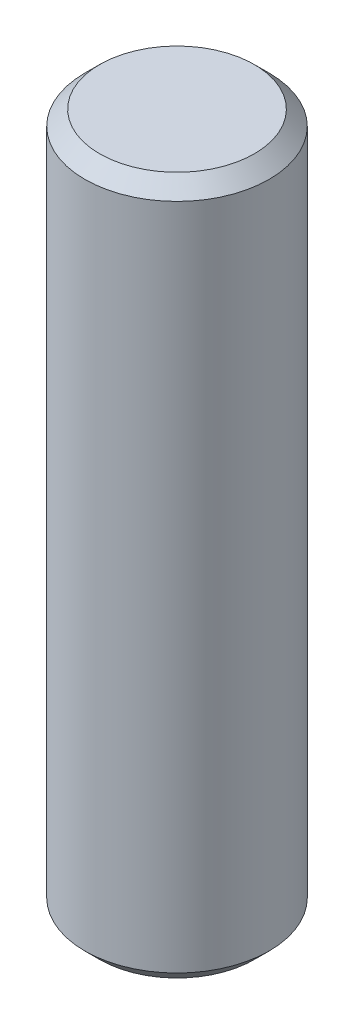
ISO-10303-21;
HEADER;
FILE_DESCRIPTION(('STEP AP214'),'2;1');
FILE_NAME('part.step','',(''),(''),'','','');
FILE_SCHEMA(('AUTOMOTIVE_DESIGN { 1 0 10303 214 1 1 1 1 }'));
ENDSEC;
DATA;
#1=APPLICATION_CONTEXT('core data for automotive mechanical design processes');
#2=APPLICATION_PROTOCOL_DEFINITION('international standard','automotive_design',2000,#1);
#3=PRODUCT_CONTEXT('',#1,'mechanical');
#4=PRODUCT('Part','Part','',(#3));
#5=PRODUCT_RELATED_PRODUCT_CATEGORY('part','',(#4));
#6=PRODUCT_DEFINITION_FORMATION('','',#4);
#7=PRODUCT_DEFINITION_CONTEXT('part definition',#1,'design');
#8=PRODUCT_DEFINITION('design','',#6,#7);
#9=PRODUCT_DEFINITION_SHAPE('','',#8);
#10=(LENGTH_UNIT() NAMED_UNIT(*) SI_UNIT(.MILLI.,.METRE.));
#11=(NAMED_UNIT(*) PLANE_ANGLE_UNIT() SI_UNIT($,.RADIAN.));
#12=(NAMED_UNIT(*) SI_UNIT($,.STERADIAN.) SOLID_ANGLE_UNIT());
#13=UNCERTAINTY_MEASURE_WITH_UNIT(LENGTH_MEASURE(1.E-05),#10,'distance_accuracy_value','');
#14=(GEOMETRIC_REPRESENTATION_CONTEXT(3) GLOBAL_UNCERTAINTY_ASSIGNED_CONTEXT((#13)) GLOBAL_UNIT_ASSIGNED_CONTEXT((#10,
#11,#12)) REPRESENTATION_CONTEXT('',''));
#15=CARTESIAN_POINT('',(0.,0.,0.));
#16=DIRECTION('',(0.,0.,1.));
#17=DIRECTION('',(1.,0.,0.));
#18=AXIS2_PLACEMENT_3D('',#15,#16,#17);
#19=CARTESIAN_POINT('',(0.,24.,0.));
#20=DIRECTION('',(0.,-1.,0.));
#21=DIRECTION('',(0.,0.,-1.));
#22=AXIS2_PLACEMENT_3D('',#19,#20,#21);
#23=CYLINDRICAL_SURFACE('',#22,3.16865);
#24=CARTESIAN_POINT('',(0.,23.492,0.));
#25=DIRECTION('',(0.,1.,0.));
#26=DIRECTION('',(0.,0.,1.));
#27=AXIS2_PLACEMENT_3D('',#24,#25,#26);
#28=CIRCLE('',#27,3.16865);
#29=CARTESIAN_POINT('',(0.,23.492,3.16865));
#30=VERTEX_POINT('',#29);
#31=EDGE_CURVE('E37',#30,#30,#28,.F.);
#32=ORIENTED_EDGE('',*,*,#31,.T.);
#33=EDGE_LOOP('',(#32));
#34=FACE_BOUND('',#33,.T.);
#35=CARTESIAN_POINT('',(0.,0.508000000000002,0.));
#36=DIRECTION('',(0.,1.,0.));
#37=DIRECTION('',(0.,0.,1.));
#38=AXIS2_PLACEMENT_3D('',#35,#36,#37);
#39=CIRCLE('',#38,3.16865);
#40=CARTESIAN_POINT('',(0.,0.508000000000002,3.16865));
#41=VERTEX_POINT('',#40);
#42=EDGE_CURVE('E41',#41,#41,#39,.T.);
#43=ORIENTED_EDGE('',*,*,#42,.T.);
#44=EDGE_LOOP('',(#43));
#45=FACE_BOUND('',#44,.T.);
#46=ADVANCED_FACE('F30',(#34,#45),#23,.T.);
#47=CARTESIAN_POINT('',(0.,24.,0.));
#48=DIRECTION('',(0.,1.,0.));
#49=DIRECTION('',(0.,0.,1.));
#50=AXIS2_PLACEMENT_3D('',#47,#48,#49);
#51=PLANE('',#50);
#52=CARTESIAN_POINT('',(0.,24.,0.));
#53=DIRECTION('',(0.,1.,0.));
#54=DIRECTION('',(0.,0.,1.));
#55=AXIS2_PLACEMENT_3D('',#52,#53,#54);
#56=CIRCLE('',#55,2.66065);
#57=CARTESIAN_POINT('',(0.,24.,2.66065));
#58=VERTEX_POINT('',#57);
#59=EDGE_CURVE('E45',#58,#58,#56,.T.);
#60=ORIENTED_EDGE('',*,*,#59,.T.);
#61=EDGE_LOOP('',(#60));
#62=FACE_BOUND('',#61,.T.);
#63=ADVANCED_FACE('F51',(#62),#51,.T.);
#64=CARTESIAN_POINT('',(0.,0.,0.));
#65=DIRECTION('',(0.,1.,0.));
#66=DIRECTION('',(0.,0.,1.));
#67=AXIS2_PLACEMENT_3D('',#64,#65,#66);
#68=PLANE('',#67);
#69=CARTESIAN_POINT('',(0.,0.,0.));
#70=DIRECTION('',(0.,1.,0.));
#71=DIRECTION('',(0.,0.,1.));
#72=AXIS2_PLACEMENT_3D('',#69,#70,#71);
#73=CIRCLE('',#72,2.66065);
#74=CARTESIAN_POINT('',(0.,0.,2.66065));
#75=VERTEX_POINT('',#74);
#76=EDGE_CURVE('E10',#75,#75,#73,.F.);
#77=ORIENTED_EDGE('',*,*,#76,.T.);
#78=EDGE_LOOP('',(#77));
#79=FACE_BOUND('',#78,.T.);
#80=ADVANCED_FACE('F55',(#79),#68,.F.);
#81=CARTESIAN_POINT('',(0.,24.,0.));
#82=DIRECTION('',(0.,-1.,0.));
#83=DIRECTION('',(0.,0.,-1.));
#84=AXIS2_PLACEMENT_3D('',#81,#82,#83);
#85=CONICAL_SURFACE('',#84,2.66065,0.785398163397443);
#86=ORIENTED_EDGE('',*,*,#31,.F.);
#87=EDGE_LOOP('',(#86));
#88=FACE_BOUND('',#87,.T.);
#89=ORIENTED_EDGE('',*,*,#59,.F.);
#90=EDGE_LOOP('',(#89));
#91=FACE_BOUND('',#90,.T.);
#92=ADVANCED_FACE('F53',(#88,#91),#85,.T.);
#93=CARTESIAN_POINT('',(0.,0.508000000000002,0.));
#94=DIRECTION('',(0.,1.,0.));
#95=DIRECTION('',(0.,0.,1.));
#96=AXIS2_PLACEMENT_3D('',#93,#94,#95);
#97=CONICAL_SURFACE('',#96,3.16865,0.78539816339745);
#98=ORIENTED_EDGE('',*,*,#76,.F.);
#99=EDGE_LOOP('',(#98));
#100=FACE_BOUND('',#99,.T.);
#101=ORIENTED_EDGE('',*,*,#42,.F.);
#102=EDGE_LOOP('',(#101));
#103=FACE_BOUND('',#102,.T.);
#104=ADVANCED_FACE('F32',(#100,#103),#97,.T.);
#105=CLOSED_SHELL('',(#46,#63,#80,#92,#104));
#106=MANIFOLD_SOLID_BREP('B2',#105);
#107=ADVANCED_BREP_SHAPE_REPRESENTATION('',(#18,#106),#14);
#108=SHAPE_DEFINITION_REPRESENTATION(#9,#107);
ENDSEC;
END-ISO-10303-21;
